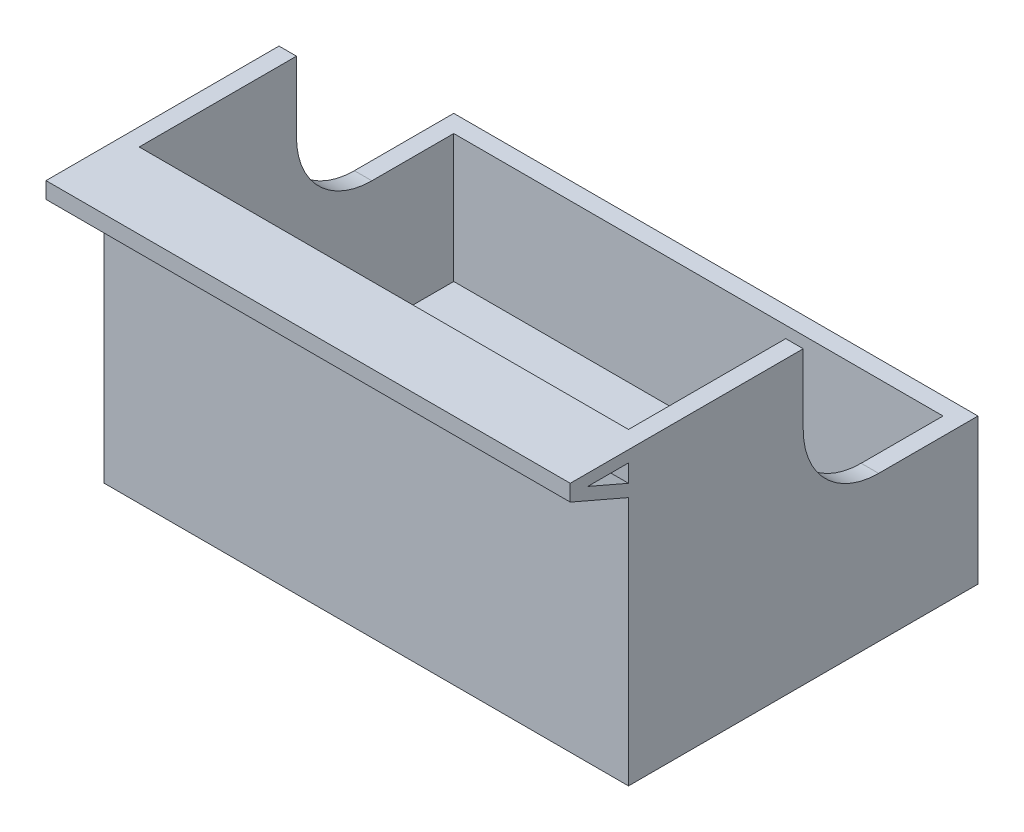
ISO-10303-21;
HEADER;
FILE_DESCRIPTION(('STEP AP214'),'2;1');
FILE_NAME('part.step','',(''),(''),'','','');
FILE_SCHEMA(('AUTOMOTIVE_DESIGN { 1 0 10303 214 1 1 1 1 }'));
ENDSEC;
DATA;
#1=APPLICATION_CONTEXT('core data for automotive mechanical design processes');
#2=APPLICATION_PROTOCOL_DEFINITION('international standard','automotive_design',2000,#1);
#3=PRODUCT_CONTEXT('',#1,'mechanical');
#4=PRODUCT('Part','Part','',(#3));
#5=PRODUCT_RELATED_PRODUCT_CATEGORY('part','',(#4));
#6=PRODUCT_DEFINITION_FORMATION('','',#4);
#7=PRODUCT_DEFINITION_CONTEXT('part definition',#1,'design');
#8=PRODUCT_DEFINITION('design','',#6,#7);
#9=PRODUCT_DEFINITION_SHAPE('','',#8);
#10=(LENGTH_UNIT() NAMED_UNIT(*) SI_UNIT(.MILLI.,.METRE.));
#11=(NAMED_UNIT(*) PLANE_ANGLE_UNIT() SI_UNIT($,.RADIAN.));
#12=(NAMED_UNIT(*) SI_UNIT($,.STERADIAN.) SOLID_ANGLE_UNIT());
#13=UNCERTAINTY_MEASURE_WITH_UNIT(LENGTH_MEASURE(1.E-05),#10,'distance_accuracy_value','');
#14=(GEOMETRIC_REPRESENTATION_CONTEXT(3) GLOBAL_UNCERTAINTY_ASSIGNED_CONTEXT((#13)) GLOBAL_UNIT_ASSIGNED_CONTEXT((#10,
#11,#12)) REPRESENTATION_CONTEXT('',''));
#15=CARTESIAN_POINT('',(0.,0.,0.));
#16=DIRECTION('',(0.,0.,1.));
#17=DIRECTION('',(1.,0.,0.));
#18=AXIS2_PLACEMENT_3D('',#15,#16,#17);
#19=CARTESIAN_POINT('',(45.,50.,30.));
#20=DIRECTION('',(0.,0.,-1.));
#21=DIRECTION('',(-1.,0.,0.));
#22=AXIS2_PLACEMENT_3D('',#19,#20,#21);
#23=PLANE('',#22);
#24=DIRECTION('',(0.,-1.,0.));
#25=VECTOR('',#24,1.);
#26=CARTESIAN_POINT('',(45.,50.,30.));
#27=LINE('',#26,#25);
#28=CARTESIAN_POINT('',(45.,42.8679828083057,30.));
#29=VERTEX_POINT('',#28);
#30=CARTESIAN_POINT('',(45.,0.,30.));
#31=VERTEX_POINT('',#30);
#32=EDGE_CURVE('E194',#29,#31,#27,.T.);
#33=ORIENTED_EDGE('',*,*,#32,.F.);
#34=DIRECTION('',(-1.,0.,0.));
#35=VECTOR('',#34,1.);
#36=CARTESIAN_POINT('',(57.2827386694753,42.8679828083057,30.));
#37=LINE('',#36,#35);
#38=CARTESIAN_POINT('',(-45.,42.8679828083057,30.));
#39=VERTEX_POINT('',#38);
#40=EDGE_CURVE('E48',#29,#39,#37,.T.);
#41=ORIENTED_EDGE('',*,*,#40,.T.);
#42=DIRECTION('',(0.,-1.,0.));
#43=VECTOR('',#42,1.);
#44=CARTESIAN_POINT('',(-45.,50.,30.));
#45=LINE('',#44,#43);
#46=CARTESIAN_POINT('',(-45.,0.,30.));
#47=VERTEX_POINT('',#46);
#48=EDGE_CURVE('E190',#39,#47,#45,.T.);
#49=ORIENTED_EDGE('',*,*,#48,.T.);
#50=DIRECTION('',(1.,0.,0.));
#51=VECTOR('',#50,1.);
#52=CARTESIAN_POINT('',(45.,0.,30.));
#53=LINE('',#52,#51);
#54=EDGE_CURVE('E246',#47,#31,#53,.T.);
#55=ORIENTED_EDGE('',*,*,#54,.T.);
#56=EDGE_LOOP('',(#33,#41,#49,#55));
#57=FACE_BOUND('',#56,.T.);
#58=ADVANCED_FACE('F33',(#57),#23,.F.);
#59=CARTESIAN_POINT('',(-45.,50.,30.));
#60=DIRECTION('',(1.,0.,0.));
#61=DIRECTION('',(0.,0.,-1.));
#62=AXIS2_PLACEMENT_3D('',#59,#60,#61);
#63=PLANE('',#62);
#64=CARTESIAN_POINT('',(-45.,48.0282746063085,30.));
#65=VERTEX_POINT('',#64);
#66=CARTESIAN_POINT('',(-45.,44.9975003124613,30.));
#67=VERTEX_POINT('',#66);
#68=EDGE_CURVE('E183',#65,#67,#45,.T.);
#69=ORIENTED_EDGE('',*,*,#68,.F.);
#70=DIRECTION('',(0.,0.,1.));
#71=VECTOR('',#70,1.);
#72=CARTESIAN_POINT('',(-45.,48.0282746063085,37.));
#73=LINE('',#72,#71);
#74=CARTESIAN_POINT('',(-45.,48.0282746063085,37.));
#75=VERTEX_POINT('',#74);
#76=EDGE_CURVE('E165',#65,#75,#73,.T.);
#77=ORIENTED_EDGE('',*,*,#76,.T.);
#78=DIRECTION('',(0.,-0.397324973686948,-0.917677974719164));
#79=VECTOR('',#78,1.);
#80=CARTESIAN_POINT('',(-45.,44.9975003124613,30.));
#81=LINE('',#80,#79);
#82=EDGE_CURVE('E177',#75,#67,#81,.T.);
#83=ORIENTED_EDGE('',*,*,#82,.T.);
#84=EDGE_LOOP('',(#69,#77,#83));
#85=FACE_BOUND('',#84,.T.);
#86=DIRECTION('',(0.,0.,1.));
#87=VECTOR('',#86,1.);
#88=CARTESIAN_POINT('',(-45.,50.,30.));
#89=LINE('',#88,#87);
#90=CARTESIAN_POINT('',(-45.,50.,0.));
#91=VERTEX_POINT('',#90);
#92=CARTESIAN_POINT('',(-45.,50.,40.));
#93=VERTEX_POINT('',#92);
#94=EDGE_CURVE('E236',#91,#93,#89,.T.);
#95=ORIENTED_EDGE('',*,*,#94,.F.);
#96=DIRECTION('',(0.,1.,0.));
#97=VECTOR('',#96,1.);
#98=CARTESIAN_POINT('',(-45.,37.9434735799459,0.));
#99=LINE('',#98,#97);
#100=CARTESIAN_POINT('',(-45.,37.9434735799459,0.));
#101=VERTEX_POINT('',#100);
#102=EDGE_CURVE('E282',#101,#91,#99,.T.);
#103=ORIENTED_EDGE('',*,*,#102,.F.);
#104=CARTESIAN_POINT('',(-45.,37.9434735799459,-12.9434735799459));
#105=DIRECTION('',(-1.,0.,0.));
#106=DIRECTION('',(0.,0.,1.));
#107=AXIS2_PLACEMENT_3D('',#104,#105,#106);
#108=CIRCLE('',#107,12.9434735799459);
#109=CARTESIAN_POINT('',(-45.,25.,-12.9434735799459));
#110=VERTEX_POINT('',#109);
#111=EDGE_CURVE('E269',#110,#101,#108,.T.);
#112=ORIENTED_EDGE('',*,*,#111,.F.);
#113=DIRECTION('',(0.,0.,1.));
#114=VECTOR('',#113,1.);
#115=CARTESIAN_POINT('',(-45.,25.,-30.));
#116=LINE('',#115,#114);
#117=CARTESIAN_POINT('',(-45.,25.,-30.));
#118=VERTEX_POINT('',#117);
#119=EDGE_CURVE('E265',#118,#110,#116,.T.);
#120=ORIENTED_EDGE('',*,*,#119,.F.);
#121=DIRECTION('',(0.,-1.,0.));
#122=VECTOR('',#121,1.);
#123=CARTESIAN_POINT('',(-45.,50.,-30.));
#124=LINE('',#123,#122);
#125=CARTESIAN_POINT('',(-45.,0.,-30.));
#126=VERTEX_POINT('',#125);
#127=EDGE_CURVE('E242',#118,#126,#124,.T.);
#128=ORIENTED_EDGE('',*,*,#127,.T.);
#129=DIRECTION('',(0.,0.,1.));
#130=VECTOR('',#129,1.);
#131=CARTESIAN_POINT('',(-45.,0.,30.));
#132=LINE('',#131,#130);
#133=EDGE_CURVE('E243',#126,#47,#132,.T.);
#134=ORIENTED_EDGE('',*,*,#133,.T.);
#135=ORIENTED_EDGE('',*,*,#48,.F.);
#136=DIRECTION('',(0.,0.397324973686949,0.917677974719163));
#137=VECTOR('',#136,1.);
#138=CARTESIAN_POINT('',(-45.,47.1976603709446,40.));
#139=LINE('',#138,#137);
#140=CARTESIAN_POINT('',(-45.,47.1976603709446,40.));
#141=VERTEX_POINT('',#140);
#142=EDGE_CURVE('E533',#39,#141,#139,.T.);
#143=ORIENTED_EDGE('',*,*,#142,.T.);
#144=DIRECTION('',(0.,1.,0.));
#145=VECTOR('',#144,1.);
#146=CARTESIAN_POINT('',(-45.,50.,40.));
#147=LINE('',#146,#145);
#148=EDGE_CURVE('E186',#141,#93,#147,.T.);
#149=ORIENTED_EDGE('',*,*,#148,.T.);
#150=EDGE_LOOP('',(#95,#103,#112,#120,#128,#134,#135,#143,#149));
#151=FACE_BOUND('',#150,.T.);
#152=ADVANCED_FACE('F35',(#85,#151),#63,.F.);
#153=ORIENTED_EDGE('',*,*,#68,.T.);
#154=DIRECTION('',(-1.,0.,0.));
#155=VECTOR('',#154,1.);
#156=CARTESIAN_POINT('',(57.2827386694753,44.9975003124613,30.));
#157=LINE('',#156,#155);
#158=CARTESIAN_POINT('',(45.,44.9975003124613,30.));
#159=VERTEX_POINT('',#158);
#160=EDGE_CURVE('E532',#159,#67,#157,.T.);
#161=ORIENTED_EDGE('',*,*,#160,.F.);
#162=CARTESIAN_POINT('',(45.,48.0282746063085,30.));
#163=VERTEX_POINT('',#162);
#164=EDGE_CURVE('E185',#163,#159,#27,.T.);
#165=ORIENTED_EDGE('',*,*,#164,.F.);
#166=DIRECTION('',(-1.,0.,0.));
#167=VECTOR('',#166,1.);
#168=CARTESIAN_POINT('',(57.2827386694753,48.0282746063085,30.));
#169=LINE('',#168,#167);
#170=EDGE_CURVE('E169',#163,#65,#169,.T.);
#171=ORIENTED_EDGE('',*,*,#170,.T.);
#172=EDGE_LOOP('',(#153,#161,#165,#171));
#173=FACE_BOUND('',#172,.T.);
#174=ADVANCED_FACE('F181',(#173),#23,.F.);
#175=CARTESIAN_POINT('',(45.,50.,30.));
#176=DIRECTION('',(-1.,0.,0.));
#177=DIRECTION('',(0.,0.,1.));
#178=AXIS2_PLACEMENT_3D('',#175,#176,#177);
#179=PLANE('',#178);
#180=DIRECTION('',(0.,0.,-1.));
#181=VECTOR('',#180,1.);
#182=CARTESIAN_POINT('',(45.,48.0282746063085,37.));
#183=LINE('',#182,#181);
#184=CARTESIAN_POINT('',(45.,48.0282746063085,37.));
#185=VERTEX_POINT('',#184);
#186=EDGE_CURVE('E264',#185,#163,#183,.T.);
#187=ORIENTED_EDGE('',*,*,#186,.T.);
#188=ORIENTED_EDGE('',*,*,#164,.T.);
#189=DIRECTION('',(0.,0.397324973686948,0.917677974719164));
#190=VECTOR('',#189,1.);
#191=CARTESIAN_POINT('',(45.,44.9975003124613,30.));
#192=LINE('',#191,#190);
#193=EDGE_CURVE('E263',#159,#185,#192,.T.);
#194=ORIENTED_EDGE('',*,*,#193,.T.);
#195=EDGE_LOOP('',(#187,#188,#194));
#196=FACE_BOUND('',#195,.T.);
#197=CARTESIAN_POINT('',(45.,37.9434735799459,-12.9434735799459));
#198=DIRECTION('',(-1.,0.,0.));
#199=DIRECTION('',(0.,0.,1.));
#200=AXIS2_PLACEMENT_3D('',#197,#198,#199);
#201=CIRCLE('',#200,12.9434735799459);
#202=CARTESIAN_POINT('',(45.,37.9434735799459,0.));
#203=VERTEX_POINT('',#202);
#204=CARTESIAN_POINT('',(45.,25.,-12.9434735799459));
#205=VERTEX_POINT('',#204);
#206=EDGE_CURVE('E275',#203,#205,#201,.F.);
#207=ORIENTED_EDGE('',*,*,#206,.F.);
#208=DIRECTION('',(0.,-1.,0.));
#209=VECTOR('',#208,1.);
#210=CARTESIAN_POINT('',(45.,37.9434735799459,0.));
#211=LINE('',#210,#209);
#212=CARTESIAN_POINT('',(45.,50.,0.));
#213=VERTEX_POINT('',#212);
#214=EDGE_CURVE('E213',#213,#203,#211,.T.);
#215=ORIENTED_EDGE('',*,*,#214,.F.);
#216=DIRECTION('',(0.,0.,-1.));
#217=VECTOR('',#216,1.);
#218=CARTESIAN_POINT('',(45.,50.,30.));
#219=LINE('',#218,#217);
#220=CARTESIAN_POINT('',(45.,50.,40.));
#221=VERTEX_POINT('',#220);
#222=EDGE_CURVE('E238',#221,#213,#219,.T.);
#223=ORIENTED_EDGE('',*,*,#222,.F.);
#224=DIRECTION('',(0.,-1.,0.));
#225=VECTOR('',#224,1.);
#226=CARTESIAN_POINT('',(45.,50.,40.));
#227=LINE('',#226,#225);
#228=CARTESIAN_POINT('',(45.,47.1976603709446,40.));
#229=VERTEX_POINT('',#228);
#230=EDGE_CURVE('E266',#221,#229,#227,.T.);
#231=ORIENTED_EDGE('',*,*,#230,.T.);
#232=DIRECTION('',(0.,-0.397324973686949,-0.917677974719163));
#233=VECTOR('',#232,1.);
#234=CARTESIAN_POINT('',(45.,47.1976603709446,40.));
#235=LINE('',#234,#233);
#236=EDGE_CURVE('E271',#229,#29,#235,.T.);
#237=ORIENTED_EDGE('',*,*,#236,.T.);
#238=ORIENTED_EDGE('',*,*,#32,.T.);
#239=DIRECTION('',(0.,0.,-1.));
#240=VECTOR('',#239,1.);
#241=CARTESIAN_POINT('',(45.,0.,30.));
#242=LINE('',#241,#240);
#243=CARTESIAN_POINT('',(45.,0.,-30.));
#244=VERTEX_POINT('',#243);
#245=EDGE_CURVE('E250',#31,#244,#242,.T.);
#246=ORIENTED_EDGE('',*,*,#245,.T.);
#247=DIRECTION('',(0.,-1.,0.));
#248=VECTOR('',#247,1.);
#249=CARTESIAN_POINT('',(45.,50.,-30.));
#250=LINE('',#249,#248);
#251=CARTESIAN_POINT('',(45.,25.,-30.));
#252=VERTEX_POINT('',#251);
#253=EDGE_CURVE('E255',#252,#244,#250,.T.);
#254=ORIENTED_EDGE('',*,*,#253,.F.);
#255=DIRECTION('',(0.,0.,-1.));
#256=VECTOR('',#255,1.);
#257=CARTESIAN_POINT('',(45.,25.,-30.));
#258=LINE('',#257,#256);
#259=EDGE_CURVE('E278',#205,#252,#258,.T.);
#260=ORIENTED_EDGE('',*,*,#259,.F.);
#261=EDGE_LOOP('',(#207,#215,#223,#231,#237,#238,#246,#254,#260));
#262=FACE_BOUND('',#261,.T.);
#263=ADVANCED_FACE('F262',(#196,#262),#179,.F.);
#264=CARTESIAN_POINT('',(45.,50.,-30.));
#265=DIRECTION('',(0.,0.,1.));
#266=DIRECTION('',(1.,0.,0.));
#267=AXIS2_PLACEMENT_3D('',#264,#265,#266);
#268=PLANE('',#267);
#269=ORIENTED_EDGE('',*,*,#127,.F.);
#270=DIRECTION('',(-1.,0.,0.));
#271=VECTOR('',#270,1.);
#272=CARTESIAN_POINT('',(84.0512483795333,25.,-30.));
#273=LINE('',#272,#271);
#274=EDGE_CURVE('E284',#252,#118,#273,.T.);
#275=ORIENTED_EDGE('',*,*,#274,.F.);
#276=ORIENTED_EDGE('',*,*,#253,.T.);
#277=DIRECTION('',(-1.,0.,0.));
#278=VECTOR('',#277,1.);
#279=CARTESIAN_POINT('',(45.,0.,-30.));
#280=LINE('',#279,#278);
#281=EDGE_CURVE('E239',#244,#126,#280,.T.);
#282=ORIENTED_EDGE('',*,*,#281,.T.);
#283=EDGE_LOOP('',(#269,#275,#276,#282));
#284=FACE_BOUND('',#283,.T.);
#285=ADVANCED_FACE('F325',(#284),#268,.F.);
#286=CARTESIAN_POINT('',(0.,50.,0.));
#287=DIRECTION('',(0.,1.,0.));
#288=DIRECTION('',(0.,0.,1.));
#289=AXIS2_PLACEMENT_3D('',#286,#287,#288);
#290=PLANE('',#289);
#291=DIRECTION('',(-1.,0.,0.));
#292=VECTOR('',#291,1.);
#293=CARTESIAN_POINT('',(84.0512483795333,50.,0.));
#294=LINE('',#293,#292);
#295=CARTESIAN_POINT('',(-41.9999999999999,50.,0.));
#296=VERTEX_POINT('',#295);
#297=EDGE_CURVE('E214',#296,#91,#294,.T.);
#298=ORIENTED_EDGE('',*,*,#297,.T.);
#299=ORIENTED_EDGE('',*,*,#94,.T.);
#300=DIRECTION('',(-1.,0.,0.));
#301=VECTOR('',#300,1.);
#302=CARTESIAN_POINT('',(57.2827386694753,50.,40.));
#303=LINE('',#302,#301);
#304=EDGE_CURVE('E521',#221,#93,#303,.T.);
#305=ORIENTED_EDGE('',*,*,#304,.F.);
#306=ORIENTED_EDGE('',*,*,#222,.T.);
#307=CARTESIAN_POINT('',(42.,50.,0.));
#308=VERTEX_POINT('',#307);
#309=EDGE_CURVE('E277',#213,#308,#294,.T.);
#310=ORIENTED_EDGE('',*,*,#309,.T.);
#311=DIRECTION('',(0.,0.,-1.));
#312=VECTOR('',#311,1.);
#313=CARTESIAN_POINT('',(42.,50.,30.));
#314=LINE('',#313,#312);
#315=CARTESIAN_POINT('',(42.,50.,27.));
#316=VERTEX_POINT('',#315);
#317=EDGE_CURVE('E221',#316,#308,#314,.T.);
#318=ORIENTED_EDGE('',*,*,#317,.F.);
#319=DIRECTION('',(1.,0.,0.));
#320=VECTOR('',#319,1.);
#321=CARTESIAN_POINT('',(45.,50.,27.));
#322=LINE('',#321,#320);
#323=CARTESIAN_POINT('',(-42.,50.,27.));
#324=VERTEX_POINT('',#323);
#325=EDGE_CURVE('E228',#324,#316,#322,.T.);
#326=ORIENTED_EDGE('',*,*,#325,.F.);
#327=DIRECTION('',(0.,0.,1.));
#328=VECTOR('',#327,1.);
#329=CARTESIAN_POINT('',(-42.,50.,30.));
#330=LINE('',#329,#328);
#331=EDGE_CURVE('E232',#296,#324,#330,.T.);
#332=ORIENTED_EDGE('',*,*,#331,.F.);
#333=EDGE_LOOP('',(#298,#299,#305,#306,#310,#318,#326,#332));
#334=FACE_BOUND('',#333,.T.);
#335=ADVANCED_FACE('F321',(#334),#290,.T.);
#336=CARTESIAN_POINT('',(0.,0.,0.));
#337=DIRECTION('',(0.,1.,0.));
#338=DIRECTION('',(0.,0.,1.));
#339=AXIS2_PLACEMENT_3D('',#336,#337,#338);
#340=PLANE('',#339);
#341=ORIENTED_EDGE('',*,*,#133,.F.);
#342=ORIENTED_EDGE('',*,*,#281,.F.);
#343=ORIENTED_EDGE('',*,*,#245,.F.);
#344=ORIENTED_EDGE('',*,*,#54,.F.);
#345=EDGE_LOOP('',(#341,#342,#343,#344));
#346=FACE_BOUND('',#345,.T.);
#347=ADVANCED_FACE('F324',(#346),#340,.F.);
#348=CARTESIAN_POINT('',(-42.,50.,30.));
#349=DIRECTION('',(1.,0.,0.));
#350=DIRECTION('',(0.,0.,-1.));
#351=AXIS2_PLACEMENT_3D('',#348,#349,#350);
#352=PLANE('',#351);
#353=DIRECTION('',(0.,-1.,0.));
#354=VECTOR('',#353,1.);
#355=CARTESIAN_POINT('',(-42.,50.,0.));
#356=LINE('',#355,#354);
#357=CARTESIAN_POINT('',(-41.9999999999999,37.9434735799459,0.));
#358=VERTEX_POINT('',#357);
#359=EDGE_CURVE('E295',#296,#358,#356,.T.);
#360=ORIENTED_EDGE('',*,*,#359,.F.);
#361=ORIENTED_EDGE('',*,*,#331,.T.);
#362=DIRECTION('',(0.,-1.,0.));
#363=VECTOR('',#362,1.);
#364=CARTESIAN_POINT('',(-42.,50.,27.));
#365=LINE('',#364,#363);
#366=CARTESIAN_POINT('',(-42.,3.,27.));
#367=VERTEX_POINT('',#366);
#368=EDGE_CURVE('E247',#324,#367,#365,.T.);
#369=ORIENTED_EDGE('',*,*,#368,.T.);
#370=DIRECTION('',(0.,0.,1.));
#371=VECTOR('',#370,1.);
#372=CARTESIAN_POINT('',(-42.,3.,30.));
#373=LINE('',#372,#371);
#374=CARTESIAN_POINT('',(-42.,3.,-27.));
#375=VERTEX_POINT('',#374);
#376=EDGE_CURVE('E297',#375,#367,#373,.T.);
#377=ORIENTED_EDGE('',*,*,#376,.F.);
#378=DIRECTION('',(0.,-1.,0.));
#379=VECTOR('',#378,1.);
#380=CARTESIAN_POINT('',(-42.,50.,-27.));
#381=LINE('',#380,#379);
#382=CARTESIAN_POINT('',(-42.,25.,-27.));
#383=VERTEX_POINT('',#382);
#384=EDGE_CURVE('E227',#383,#375,#381,.T.);
#385=ORIENTED_EDGE('',*,*,#384,.F.);
#386=DIRECTION('',(0.,0.,-1.));
#387=VECTOR('',#386,1.);
#388=CARTESIAN_POINT('',(-42.,25.,30.));
#389=LINE('',#388,#387);
#390=CARTESIAN_POINT('',(-41.9999999999999,25.,-12.9434735799459));
#391=VERTEX_POINT('',#390);
#392=EDGE_CURVE('E56',#391,#383,#389,.T.);
#393=ORIENTED_EDGE('',*,*,#392,.F.);
#394=CARTESIAN_POINT('',(-42.,37.9434735799459,-12.9434735799459));
#395=DIRECTION('',(1.,0.,0.));
#396=DIRECTION('',(0.,0.,-1.));
#397=AXIS2_PLACEMENT_3D('',#394,#395,#396);
#398=CIRCLE('',#397,12.9434735799459);
#399=EDGE_CURVE('E293',#358,#391,#398,.T.);
#400=ORIENTED_EDGE('',*,*,#399,.F.);
#401=EDGE_LOOP('',(#360,#361,#369,#377,#385,#393,#400));
#402=FACE_BOUND('',#401,.T.);
#403=ADVANCED_FACE('F315',(#402),#352,.T.);
#404=CARTESIAN_POINT('',(45.,50.,27.));
#405=DIRECTION('',(0.,0.,-1.));
#406=DIRECTION('',(-1.,0.,0.));
#407=AXIS2_PLACEMENT_3D('',#404,#405,#406);
#408=PLANE('',#407);
#409=DIRECTION('',(1.,0.,0.));
#410=VECTOR('',#409,1.);
#411=CARTESIAN_POINT('',(45.,3.,27.));
#412=LINE('',#411,#410);
#413=CARTESIAN_POINT('',(42.,3.,27.));
#414=VERTEX_POINT('',#413);
#415=EDGE_CURVE('E300',#367,#414,#412,.T.);
#416=ORIENTED_EDGE('',*,*,#415,.F.);
#417=ORIENTED_EDGE('',*,*,#368,.F.);
#418=ORIENTED_EDGE('',*,*,#325,.T.);
#419=DIRECTION('',(0.,-1.,0.));
#420=VECTOR('',#419,1.);
#421=CARTESIAN_POINT('',(42.,50.,27.));
#422=LINE('',#421,#420);
#423=EDGE_CURVE('E224',#316,#414,#422,.T.);
#424=ORIENTED_EDGE('',*,*,#423,.T.);
#425=EDGE_LOOP('',(#416,#417,#418,#424));
#426=FACE_BOUND('',#425,.T.);
#427=ADVANCED_FACE('F320',(#426),#408,.T.);
#428=CARTESIAN_POINT('',(42.,50.,30.));
#429=DIRECTION('',(-1.,0.,0.));
#430=DIRECTION('',(0.,0.,1.));
#431=AXIS2_PLACEMENT_3D('',#428,#429,#430);
#432=PLANE('',#431);
#433=DIRECTION('',(0.,1.,0.));
#434=VECTOR('',#433,1.);
#435=CARTESIAN_POINT('',(42.,50.,0.));
#436=LINE('',#435,#434);
#437=CARTESIAN_POINT('',(42.,37.9434735799459,0.));
#438=VERTEX_POINT('',#437);
#439=EDGE_CURVE('E11',#438,#308,#436,.T.);
#440=ORIENTED_EDGE('',*,*,#439,.F.);
#441=CARTESIAN_POINT('',(42.,37.9434735799459,-12.9434735799459));
#442=DIRECTION('',(-1.,0.,0.));
#443=DIRECTION('',(0.,0.,1.));
#444=AXIS2_PLACEMENT_3D('',#441,#442,#443);
#445=CIRCLE('',#444,12.9434735799459);
#446=CARTESIAN_POINT('',(42.,25.,-12.9434735799459));
#447=VERTEX_POINT('',#446);
#448=EDGE_CURVE('E41',#447,#438,#445,.T.);
#449=ORIENTED_EDGE('',*,*,#448,.F.);
#450=DIRECTION('',(0.,0.,1.));
#451=VECTOR('',#450,1.);
#452=CARTESIAN_POINT('',(42.,25.,30.));
#453=LINE('',#452,#451);
#454=CARTESIAN_POINT('',(42.,25.,-27.));
#455=VERTEX_POINT('',#454);
#456=EDGE_CURVE('E290',#455,#447,#453,.T.);
#457=ORIENTED_EDGE('',*,*,#456,.F.);
#458=DIRECTION('',(0.,-1.,0.));
#459=VECTOR('',#458,1.);
#460=CARTESIAN_POINT('',(42.,50.,-27.));
#461=LINE('',#460,#459);
#462=CARTESIAN_POINT('',(42.,3.,-27.));
#463=VERTEX_POINT('',#462);
#464=EDGE_CURVE('E230',#455,#463,#461,.T.);
#465=ORIENTED_EDGE('',*,*,#464,.T.);
#466=DIRECTION('',(0.,0.,-1.));
#467=VECTOR('',#466,1.);
#468=CARTESIAN_POINT('',(42.,3.,30.));
#469=LINE('',#468,#467);
#470=EDGE_CURVE('E304',#414,#463,#469,.T.);
#471=ORIENTED_EDGE('',*,*,#470,.F.);
#472=ORIENTED_EDGE('',*,*,#423,.F.);
#473=ORIENTED_EDGE('',*,*,#317,.T.);
#474=EDGE_LOOP('',(#440,#449,#457,#465,#471,#472,#473));
#475=FACE_BOUND('',#474,.T.);
#476=ADVANCED_FACE('F218',(#475),#432,.T.);
#477=CARTESIAN_POINT('',(45.,50.,-27.));
#478=DIRECTION('',(0.,0.,1.));
#479=DIRECTION('',(1.,0.,0.));
#480=AXIS2_PLACEMENT_3D('',#477,#478,#479);
#481=PLANE('',#480);
#482=DIRECTION('',(1.,0.,0.));
#483=VECTOR('',#482,1.);
#484=CARTESIAN_POINT('',(45.,25.,-27.));
#485=LINE('',#484,#483);
#486=EDGE_CURVE('E189',#383,#455,#485,.T.);
#487=ORIENTED_EDGE('',*,*,#486,.F.);
#488=ORIENTED_EDGE('',*,*,#384,.T.);
#489=DIRECTION('',(-1.,0.,0.));
#490=VECTOR('',#489,1.);
#491=CARTESIAN_POINT('',(45.,3.,-27.));
#492=LINE('',#491,#490);
#493=EDGE_CURVE('E308',#463,#375,#492,.T.);
#494=ORIENTED_EDGE('',*,*,#493,.F.);
#495=ORIENTED_EDGE('',*,*,#464,.F.);
#496=EDGE_LOOP('',(#487,#488,#494,#495));
#497=FACE_BOUND('',#496,.T.);
#498=ADVANCED_FACE('F379',(#497),#481,.T.);
#499=CARTESIAN_POINT('',(0.,3.,0.));
#500=DIRECTION('',(0.,1.,0.));
#501=DIRECTION('',(0.,0.,1.));
#502=AXIS2_PLACEMENT_3D('',#499,#500,#501);
#503=PLANE('',#502);
#504=ORIENTED_EDGE('',*,*,#376,.T.);
#505=ORIENTED_EDGE('',*,*,#415,.T.);
#506=ORIENTED_EDGE('',*,*,#470,.T.);
#507=ORIENTED_EDGE('',*,*,#493,.T.);
#508=EDGE_LOOP('',(#504,#505,#506,#507));
#509=FACE_BOUND('',#508,.T.);
#510=ADVANCED_FACE('F359',(#509),#503,.T.);
#511=CARTESIAN_POINT('',(84.0512483795333,37.9434735799459,0.));
#512=DIRECTION('',(0.,0.,1.));
#513=DIRECTION('',(0.,-1.,0.));
#514=AXIS2_PLACEMENT_3D('',#511,#512,#513);
#515=PLANE('',#514);
#516=ORIENTED_EDGE('',*,*,#359,.T.);
#517=DIRECTION('',(-1.,0.,0.));
#518=VECTOR('',#517,1.);
#519=CARTESIAN_POINT('',(84.0512483795333,37.9434735799459,0.));
#520=LINE('',#519,#518);
#521=EDGE_CURVE('E215',#358,#101,#520,.T.);
#522=ORIENTED_EDGE('',*,*,#521,.T.);
#523=ORIENTED_EDGE('',*,*,#102,.T.);
#524=ORIENTED_EDGE('',*,*,#297,.F.);
#525=EDGE_LOOP('',(#516,#522,#523,#524));
#526=FACE_BOUND('',#525,.T.);
#527=ADVANCED_FACE('F393',(#526),#515,.F.);
#528=CARTESIAN_POINT('',(84.0512483795333,37.9434735799459,-12.9434735799459));
#529=DIRECTION('',(-1.,0.,0.));
#530=DIRECTION('',(0.,0.,1.));
#531=AXIS2_PLACEMENT_3D('',#528,#529,#530);
#532=CYLINDRICAL_SURFACE('',#531,12.9434735799459);
#533=ORIENTED_EDGE('',*,*,#399,.T.);
#534=DIRECTION('',(-1.,0.,0.));
#535=VECTOR('',#534,1.);
#536=CARTESIAN_POINT('',(84.0512483795333,25.,-12.9434735799459));
#537=LINE('',#536,#535);
#538=EDGE_CURVE('E287',#391,#110,#537,.T.);
#539=ORIENTED_EDGE('',*,*,#538,.T.);
#540=ORIENTED_EDGE('',*,*,#111,.T.);
#541=ORIENTED_EDGE('',*,*,#521,.F.);
#542=EDGE_LOOP('',(#533,#539,#540,#541));
#543=FACE_BOUND('',#542,.T.);
#544=ADVANCED_FACE('F398',(#543),#532,.F.);
#545=ORIENTED_EDGE('',*,*,#439,.T.);
#546=ORIENTED_EDGE('',*,*,#309,.F.);
#547=ORIENTED_EDGE('',*,*,#214,.T.);
#548=EDGE_CURVE('E202',#203,#438,#520,.T.);
#549=ORIENTED_EDGE('',*,*,#548,.T.);
#550=EDGE_LOOP('',(#545,#546,#547,#549));
#551=FACE_BOUND('',#550,.T.);
#552=ADVANCED_FACE('F210',(#551),#515,.F.);
#553=ORIENTED_EDGE('',*,*,#448,.T.);
#554=ORIENTED_EDGE('',*,*,#548,.F.);
#555=ORIENTED_EDGE('',*,*,#206,.T.);
#556=EDGE_CURVE('E205',#205,#447,#537,.T.);
#557=ORIENTED_EDGE('',*,*,#556,.T.);
#558=EDGE_LOOP('',(#553,#554,#555,#557));
#559=FACE_BOUND('',#558,.T.);
#560=ADVANCED_FACE('F201',(#559),#532,.F.);
#561=CARTESIAN_POINT('',(84.0512483795333,25.,-30.));
#562=DIRECTION('',(0.,-1.,0.));
#563=DIRECTION('',(0.,0.,-1.));
#564=AXIS2_PLACEMENT_3D('',#561,#562,#563);
#565=PLANE('',#564);
#566=ORIENTED_EDGE('',*,*,#392,.T.);
#567=ORIENTED_EDGE('',*,*,#486,.T.);
#568=ORIENTED_EDGE('',*,*,#456,.T.);
#569=ORIENTED_EDGE('',*,*,#556,.F.);
#570=ORIENTED_EDGE('',*,*,#259,.T.);
#571=ORIENTED_EDGE('',*,*,#274,.T.);
#572=ORIENTED_EDGE('',*,*,#119,.T.);
#573=ORIENTED_EDGE('',*,*,#538,.F.);
#574=EDGE_LOOP('',(#566,#567,#568,#569,#570,#571,#572,#573));
#575=FACE_BOUND('',#574,.T.);
#576=ADVANCED_FACE('F424',(#575),#565,.F.);
#577=CARTESIAN_POINT('',(57.2827386694753,50.,40.));
#578=DIRECTION('',(0.,0.,1.));
#579=DIRECTION('',(1.,0.,0.));
#580=AXIS2_PLACEMENT_3D('',#577,#578,#579);
#581=PLANE('',#580);
#582=ORIENTED_EDGE('',*,*,#230,.F.);
#583=ORIENTED_EDGE('',*,*,#304,.T.);
#584=ORIENTED_EDGE('',*,*,#148,.F.);
#585=DIRECTION('',(-1.,0.,0.));
#586=VECTOR('',#585,1.);
#587=CARTESIAN_POINT('',(57.2827386694753,47.1976603709446,40.));
#588=LINE('',#587,#586);
#589=EDGE_CURVE('E524',#229,#141,#588,.T.);
#590=ORIENTED_EDGE('',*,*,#589,.F.);
#591=EDGE_LOOP('',(#582,#583,#584,#590));
#592=FACE_BOUND('',#591,.T.);
#593=ADVANCED_FACE('F431',(#592),#581,.T.);
#594=CARTESIAN_POINT('',(57.2827386694753,47.1976603709446,40.));
#595=DIRECTION('',(0.,-0.917677974719163,0.397324973686949));
#596=DIRECTION('',(0.,-0.397324973686949,-0.917677974719163));
#597=AXIS2_PLACEMENT_3D('',#594,#595,#596);
#598=PLANE('',#597);
#599=ORIENTED_EDGE('',*,*,#236,.F.);
#600=ORIENTED_EDGE('',*,*,#589,.T.);
#601=ORIENTED_EDGE('',*,*,#142,.F.);
#602=ORIENTED_EDGE('',*,*,#40,.F.);
#603=EDGE_LOOP('',(#599,#600,#601,#602));
#604=FACE_BOUND('',#603,.T.);
#605=ADVANCED_FACE('F469',(#604),#598,.T.);
#606=CARTESIAN_POINT('',(57.2827386694753,44.9975003124613,30.));
#607=DIRECTION('',(0.,0.917677974719164,-0.397324973686948));
#608=DIRECTION('',(0.,0.397324973686948,0.917677974719164));
#609=AXIS2_PLACEMENT_3D('',#606,#607,#608);
#610=PLANE('',#609);
#611=ORIENTED_EDGE('',*,*,#193,.F.);
#612=ORIENTED_EDGE('',*,*,#160,.T.);
#613=ORIENTED_EDGE('',*,*,#82,.F.);
#614=DIRECTION('',(-1.,0.,0.));
#615=VECTOR('',#614,1.);
#616=CARTESIAN_POINT('',(57.2827386694753,48.0282746063085,37.));
#617=LINE('',#616,#615);
#618=EDGE_CURVE('E172',#185,#75,#617,.T.);
#619=ORIENTED_EDGE('',*,*,#618,.F.);
#620=EDGE_LOOP('',(#611,#612,#613,#619));
#621=FACE_BOUND('',#620,.T.);
#622=ADVANCED_FACE('F478',(#621),#610,.T.);
#623=CARTESIAN_POINT('',(57.2827386694753,48.0282746063085,37.));
#624=DIRECTION('',(0.,-1.,0.));
#625=DIRECTION('',(0.,0.,-1.));
#626=AXIS2_PLACEMENT_3D('',#623,#624,#625);
#627=PLANE('',#626);
#628=ORIENTED_EDGE('',*,*,#186,.F.);
#629=ORIENTED_EDGE('',*,*,#618,.T.);
#630=ORIENTED_EDGE('',*,*,#76,.F.);
#631=ORIENTED_EDGE('',*,*,#170,.F.);
#632=EDGE_LOOP('',(#628,#629,#630,#631));
#633=FACE_BOUND('',#632,.T.);
#634=ADVANCED_FACE('F168',(#633),#627,.T.);
#635=CLOSED_SHELL('',(#58,#152,#174,#263,#285,#335,#347,#403,#427,#476,#498,#510,#527,#544,#552,
#560,#576,#593,#605,#622,#634));
#636=MANIFOLD_SOLID_BREP('B2',#635);
#637=ADVANCED_BREP_SHAPE_REPRESENTATION('',(#18,#636),#14);
#638=SHAPE_DEFINITION_REPRESENTATION(#9,#637);
ENDSEC;
END-ISO-10303-21;
